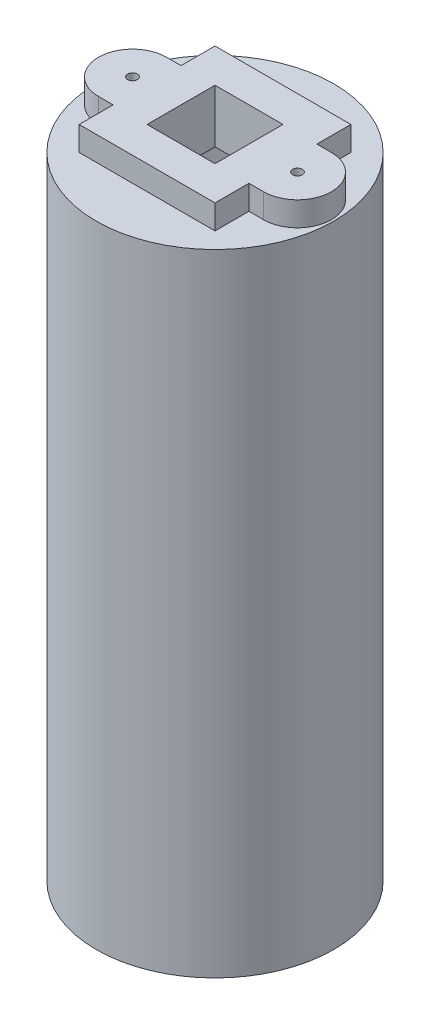
ISO-10303-21;
HEADER;
FILE_DESCRIPTION(('STEP AP214'),'2;1');
FILE_NAME('part.step','',(''),(''),'','','');
FILE_SCHEMA(('AUTOMOTIVE_DESIGN { 1 0 10303 214 1 1 1 1 }'));
ENDSEC;
DATA;
#1=APPLICATION_CONTEXT('core data for automotive mechanical design processes');
#2=APPLICATION_PROTOCOL_DEFINITION('international standard','automotive_design',2000,#1);
#3=PRODUCT_CONTEXT('',#1,'mechanical');
#4=PRODUCT('Part','Part','',(#3));
#5=PRODUCT_RELATED_PRODUCT_CATEGORY('part','',(#4));
#6=PRODUCT_DEFINITION_FORMATION('','',#4);
#7=PRODUCT_DEFINITION_CONTEXT('part definition',#1,'design');
#8=PRODUCT_DEFINITION('design','',#6,#7);
#9=PRODUCT_DEFINITION_SHAPE('','',#8);
#10=(LENGTH_UNIT() NAMED_UNIT(*) SI_UNIT(.MILLI.,.METRE.));
#11=(NAMED_UNIT(*) PLANE_ANGLE_UNIT() SI_UNIT($,.RADIAN.));
#12=(NAMED_UNIT(*) SI_UNIT($,.STERADIAN.) SOLID_ANGLE_UNIT());
#13=UNCERTAINTY_MEASURE_WITH_UNIT(LENGTH_MEASURE(1.E-05),#10,'distance_accuracy_value','');
#14=(GEOMETRIC_REPRESENTATION_CONTEXT(3) GLOBAL_UNCERTAINTY_ASSIGNED_CONTEXT((#13)) GLOBAL_UNIT_ASSIGNED_CONTEXT((#10,
#11,#12)) REPRESENTATION_CONTEXT('',''));
#15=CARTESIAN_POINT('',(0.,0.,0.));
#16=DIRECTION('',(0.,0.,1.));
#17=DIRECTION('',(1.,0.,0.));
#18=AXIS2_PLACEMENT_3D('',#15,#16,#17);
#19=CARTESIAN_POINT('',(0.,0.,0.));
#20=DIRECTION('',(0.,1.,0.));
#21=DIRECTION('',(0.,0.,1.));
#22=AXIS2_PLACEMENT_3D('',#19,#20,#21);
#23=PLANE('',#22);
#24=CARTESIAN_POINT('',(0.,0.,0.));
#25=DIRECTION('',(0.,1.,0.));
#26=DIRECTION('',(0.,0.,1.));
#27=AXIS2_PLACEMENT_3D('',#24,#25,#26);
#28=CIRCLE('',#27,12.25);
#29=CARTESIAN_POINT('',(0.,0.,12.25));
#30=VERTEX_POINT('',#29);
#31=EDGE_CURVE('E156',#30,#30,#28,.T.);
#32=ORIENTED_EDGE('',*,*,#31,.F.);
#33=EDGE_LOOP('',(#32));
#34=FACE_BOUND('',#33,.T.);
#35=CARTESIAN_POINT('',(0.,0.,0.));
#36=DIRECTION('',(0.,1.,0.));
#37=DIRECTION('',(0.,0.,1.));
#38=AXIS2_PLACEMENT_3D('',#35,#36,#37);
#39=CIRCLE('',#38,10.5);
#40=CARTESIAN_POINT('',(0.,0.,10.5));
#41=VERTEX_POINT('',#40);
#42=EDGE_CURVE('E174',#41,#41,#39,.T.);
#43=ORIENTED_EDGE('',*,*,#42,.T.);
#44=EDGE_LOOP('',(#43));
#45=FACE_BOUND('',#44,.T.);
#46=ADVANCED_FACE('F41',(#34,#45),#23,.F.);
#47=CARTESIAN_POINT('',(0.,62.,0.));
#48=DIRECTION('',(0.,-1.,0.));
#49=DIRECTION('',(0.,0.,-1.));
#50=AXIS2_PLACEMENT_3D('',#47,#48,#49);
#51=CYLINDRICAL_SURFACE('',#50,12.25);
#52=ORIENTED_EDGE('',*,*,#31,.T.);
#53=EDGE_LOOP('',(#52));
#54=FACE_BOUND('',#53,.T.);
#55=CARTESIAN_POINT('',(0.,65.,0.));
#56=DIRECTION('',(0.,1.,0.));
#57=DIRECTION('',(0.,0.,1.));
#58=AXIS2_PLACEMENT_3D('',#55,#56,#57);
#59=CIRCLE('',#58,12.25);
#60=CARTESIAN_POINT('',(0.,65.,12.25));
#61=VERTEX_POINT('',#60);
#62=EDGE_CURVE('E180',#61,#61,#59,.T.);
#63=ORIENTED_EDGE('',*,*,#62,.F.);
#64=EDGE_LOOP('',(#63));
#65=FACE_BOUND('',#64,.T.);
#66=ADVANCED_FACE('F43',(#54,#65),#51,.T.);
#67=CARTESIAN_POINT('',(0.,62.,0.));
#68=DIRECTION('',(0.,-1.,0.));
#69=DIRECTION('',(0.,0.,-1.));
#70=AXIS2_PLACEMENT_3D('',#67,#68,#69);
#71=CYLINDRICAL_SURFACE('',#70,10.5);
#72=CARTESIAN_POINT('',(0.,62.,0.));
#73=DIRECTION('',(0.,1.,0.));
#74=DIRECTION('',(0.,0.,1.));
#75=AXIS2_PLACEMENT_3D('',#72,#73,#74);
#76=CIRCLE('',#75,10.5);
#77=CARTESIAN_POINT('',(0.,62.,10.5));
#78=VERTEX_POINT('',#77);
#79=EDGE_CURVE('E177',#78,#78,#76,.T.);
#80=ORIENTED_EDGE('',*,*,#79,.T.);
#81=EDGE_LOOP('',(#80));
#82=FACE_BOUND('',#81,.T.);
#83=ORIENTED_EDGE('',*,*,#42,.F.);
#84=EDGE_LOOP('',(#83));
#85=FACE_BOUND('',#84,.T.);
#86=ADVANCED_FACE('F307',(#82,#85),#71,.F.);
#87=CARTESIAN_POINT('',(0.,62.,0.));
#88=DIRECTION('',(0.,1.,0.));
#89=DIRECTION('',(0.,0.,1.));
#90=AXIS2_PLACEMENT_3D('',#87,#88,#89);
#91=PLANE('',#90);
#92=DIRECTION('',(1.,0.,0.));
#93=VECTOR('',#92,1.);
#94=CARTESIAN_POINT('',(0.,62.,3.5));
#95=LINE('',#94,#93);
#96=CARTESIAN_POINT('',(-3.5,62.,3.5));
#97=VERTEX_POINT('',#96);
#98=CARTESIAN_POINT('',(3.5,62.,3.5));
#99=VERTEX_POINT('',#98);
#100=EDGE_CURVE('E287',#97,#99,#95,.T.);
#101=ORIENTED_EDGE('',*,*,#100,.T.);
#102=DIRECTION('',(0.,0.,-1.));
#103=VECTOR('',#102,1.);
#104=CARTESIAN_POINT('',(3.5,62.,0.));
#105=LINE('',#104,#103);
#106=CARTESIAN_POINT('',(3.5,62.,-3.5));
#107=VERTEX_POINT('',#106);
#108=EDGE_CURVE('E251',#99,#107,#105,.T.);
#109=ORIENTED_EDGE('',*,*,#108,.T.);
#110=DIRECTION('',(-1.,0.,0.));
#111=VECTOR('',#110,1.);
#112=CARTESIAN_POINT('',(0.,62.,-3.5));
#113=LINE('',#112,#111);
#114=CARTESIAN_POINT('',(-3.5,62.,-3.5));
#115=VERTEX_POINT('',#114);
#116=EDGE_CURVE('E291',#107,#115,#113,.T.);
#117=ORIENTED_EDGE('',*,*,#116,.T.);
#118=DIRECTION('',(0.,0.,1.));
#119=VECTOR('',#118,1.);
#120=CARTESIAN_POINT('',(-3.5,62.,0.));
#121=LINE('',#120,#119);
#122=EDGE_CURVE('E163',#115,#97,#121,.T.);
#123=ORIENTED_EDGE('',*,*,#122,.T.);
#124=EDGE_LOOP('',(#101,#109,#117,#123));
#125=FACE_BOUND('',#124,.T.);
#126=ORIENTED_EDGE('',*,*,#79,.F.);
#127=EDGE_LOOP('',(#126));
#128=FACE_BOUND('',#127,.T.);
#129=ADVANCED_FACE('F303',(#125,#128),#91,.F.);
#130=CARTESIAN_POINT('',(0.,65.,0.));
#131=DIRECTION('',(0.,1.,0.));
#132=DIRECTION('',(0.,0.,1.));
#133=AXIS2_PLACEMENT_3D('',#130,#131,#132);
#134=PLANE('',#133);
#135=DIRECTION('',(0.,0.,1.));
#136=VECTOR('',#135,1.);
#137=CARTESIAN_POINT('',(-7.,65.,0.));
#138=LINE('',#137,#136);
#139=CARTESIAN_POINT('',(-7.,65.,-7.));
#140=VERTEX_POINT('',#139);
#141=CARTESIAN_POINT('',(-7.,65.,-3.5));
#142=VERTEX_POINT('',#141);
#143=EDGE_CURVE('E249',#140,#142,#138,.T.);
#144=ORIENTED_EDGE('',*,*,#143,.F.);
#145=DIRECTION('',(1.,0.,0.));
#146=VECTOR('',#145,1.);
#147=CARTESIAN_POINT('',(0.,65.,-7.));
#148=LINE('',#147,#146);
#149=CARTESIAN_POINT('',(7.,65.,-7.));
#150=VERTEX_POINT('',#149);
#151=EDGE_CURVE('E220',#140,#150,#148,.T.);
#152=ORIENTED_EDGE('',*,*,#151,.T.);
#153=DIRECTION('',(0.,0.,1.));
#154=VECTOR('',#153,1.);
#155=CARTESIAN_POINT('',(7.,65.,0.));
#156=LINE('',#155,#154);
#157=CARTESIAN_POINT('',(7.,65.,-3.5));
#158=VERTEX_POINT('',#157);
#159=EDGE_CURVE('E223',#150,#158,#156,.T.);
#160=ORIENTED_EDGE('',*,*,#159,.T.);
#161=DIRECTION('',(1.,0.,0.));
#162=VECTOR('',#161,1.);
#163=CARTESIAN_POINT('',(0.,65.,-3.5));
#164=LINE('',#163,#162);
#165=CARTESIAN_POINT('',(8.5,65.,-3.5));
#166=VERTEX_POINT('',#165);
#167=EDGE_CURVE('E226',#158,#166,#164,.T.);
#168=ORIENTED_EDGE('',*,*,#167,.T.);
#169=CARTESIAN_POINT('',(8.5,65.,0.));
#170=DIRECTION('',(0.,1.,0.));
#171=DIRECTION('',(0.,0.,1.));
#172=AXIS2_PLACEMENT_3D('',#169,#170,#171);
#173=CIRCLE('',#172,3.5);
#174=CARTESIAN_POINT('',(8.5,65.,3.5));
#175=VERTEX_POINT('',#174);
#176=EDGE_CURVE('E229',#175,#166,#173,.T.);
#177=ORIENTED_EDGE('',*,*,#176,.F.);
#178=DIRECTION('',(1.,0.,0.));
#179=VECTOR('',#178,1.);
#180=CARTESIAN_POINT('',(0.,65.,3.5));
#181=LINE('',#180,#179);
#182=CARTESIAN_POINT('',(7.,65.,3.5));
#183=VERTEX_POINT('',#182);
#184=EDGE_CURVE('E232',#183,#175,#181,.T.);
#185=ORIENTED_EDGE('',*,*,#184,.F.);
#186=DIRECTION('',(0.,0.,1.));
#187=VECTOR('',#186,1.);
#188=CARTESIAN_POINT('',(7.,65.,0.));
#189=LINE('',#188,#187);
#190=CARTESIAN_POINT('',(7.,65.,7.));
#191=VERTEX_POINT('',#190);
#192=EDGE_CURVE('E234',#183,#191,#189,.T.);
#193=ORIENTED_EDGE('',*,*,#192,.T.);
#194=DIRECTION('',(1.,0.,0.));
#195=VECTOR('',#194,1.);
#196=CARTESIAN_POINT('',(0.,65.,7.));
#197=LINE('',#196,#195);
#198=CARTESIAN_POINT('',(-7.,65.,7.));
#199=VERTEX_POINT('',#198);
#200=EDGE_CURVE('E237',#199,#191,#197,.T.);
#201=ORIENTED_EDGE('',*,*,#200,.F.);
#202=DIRECTION('',(0.,0.,1.));
#203=VECTOR('',#202,1.);
#204=CARTESIAN_POINT('',(-7.,65.,0.));
#205=LINE('',#204,#203);
#206=CARTESIAN_POINT('',(-7.,65.,3.5));
#207=VERTEX_POINT('',#206);
#208=EDGE_CURVE('E240',#207,#199,#205,.T.);
#209=ORIENTED_EDGE('',*,*,#208,.F.);
#210=DIRECTION('',(1.,0.,0.));
#211=VECTOR('',#210,1.);
#212=CARTESIAN_POINT('',(0.,65.,3.5));
#213=LINE('',#212,#211);
#214=CARTESIAN_POINT('',(-8.5,65.,3.5));
#215=VERTEX_POINT('',#214);
#216=EDGE_CURVE('E242',#215,#207,#213,.T.);
#217=ORIENTED_EDGE('',*,*,#216,.F.);
#218=CARTESIAN_POINT('',(-8.5,65.,0.));
#219=DIRECTION('',(0.,1.,0.));
#220=DIRECTION('',(0.,0.,1.));
#221=AXIS2_PLACEMENT_3D('',#218,#219,#220);
#222=CIRCLE('',#221,3.5);
#223=CARTESIAN_POINT('',(-8.5,65.,-3.5));
#224=VERTEX_POINT('',#223);
#225=EDGE_CURVE('E244',#224,#215,#222,.T.);
#226=ORIENTED_EDGE('',*,*,#225,.F.);
#227=DIRECTION('',(1.,0.,0.));
#228=VECTOR('',#227,1.);
#229=CARTESIAN_POINT('',(0.,65.,-3.5));
#230=LINE('',#229,#228);
#231=EDGE_CURVE('E246',#224,#142,#230,.T.);
#232=ORIENTED_EDGE('',*,*,#231,.T.);
#233=EDGE_LOOP('',(#144,#152,#160,#168,#177,#185,#193,#201,#209,#217,#226,#232));
#234=FACE_BOUND('',#233,.T.);
#235=ORIENTED_EDGE('',*,*,#62,.T.);
#236=EDGE_LOOP('',(#235));
#237=FACE_BOUND('',#236,.T.);
#238=ADVANCED_FACE('F306',(#234,#237),#134,.T.);
#239=CARTESIAN_POINT('',(-7.,67.5,0.));
#240=DIRECTION('',(1.,0.,0.));
#241=DIRECTION('',(0.,0.,-1.));
#242=AXIS2_PLACEMENT_3D('',#239,#240,#241);
#243=PLANE('',#242);
#244=ORIENTED_EDGE('',*,*,#143,.T.);
#245=DIRECTION('',(0.,-1.,0.));
#246=VECTOR('',#245,1.);
#247=CARTESIAN_POINT('',(-7.,67.5,-3.5));
#248=LINE('',#247,#246);
#249=CARTESIAN_POINT('',(-7.,67.5,-3.5));
#250=VERTEX_POINT('',#249);
#251=EDGE_CURVE('E183',#250,#142,#248,.T.);
#252=ORIENTED_EDGE('',*,*,#251,.F.);
#253=DIRECTION('',(0.,0.,1.));
#254=VECTOR('',#253,1.);
#255=CARTESIAN_POINT('',(-7.,67.5,0.));
#256=LINE('',#255,#254);
#257=CARTESIAN_POINT('',(-7.,67.5,-7.));
#258=VERTEX_POINT('',#257);
#259=EDGE_CURVE('E216',#258,#250,#256,.T.);
#260=ORIENTED_EDGE('',*,*,#259,.F.);
#261=DIRECTION('',(0.,-1.,0.));
#262=VECTOR('',#261,1.);
#263=CARTESIAN_POINT('',(-7.,67.5,-7.));
#264=LINE('',#263,#262);
#265=EDGE_CURVE('E210',#258,#140,#264,.T.);
#266=ORIENTED_EDGE('',*,*,#265,.T.);
#267=EDGE_LOOP('',(#244,#252,#260,#266));
#268=FACE_BOUND('',#267,.T.);
#269=ADVANCED_FACE('F326',(#268),#243,.F.);
#270=CARTESIAN_POINT('',(0.,67.5,-3.5));
#271=DIRECTION('',(0.,0.,-1.));
#272=DIRECTION('',(-1.,0.,0.));
#273=AXIS2_PLACEMENT_3D('',#270,#271,#272);
#274=PLANE('',#273);
#275=ORIENTED_EDGE('',*,*,#231,.F.);
#276=DIRECTION('',(0.,-1.,0.));
#277=VECTOR('',#276,1.);
#278=CARTESIAN_POINT('',(-8.5,67.5,-3.5));
#279=LINE('',#278,#277);
#280=CARTESIAN_POINT('',(-8.5,67.5,-3.5));
#281=VERTEX_POINT('',#280);
#282=EDGE_CURVE('E186',#281,#224,#279,.T.);
#283=ORIENTED_EDGE('',*,*,#282,.F.);
#284=DIRECTION('',(1.,0.,0.));
#285=VECTOR('',#284,1.);
#286=CARTESIAN_POINT('',(0.,67.5,-3.5));
#287=LINE('',#286,#285);
#288=EDGE_CURVE('E281',#281,#250,#287,.T.);
#289=ORIENTED_EDGE('',*,*,#288,.T.);
#290=ORIENTED_EDGE('',*,*,#251,.T.);
#291=EDGE_LOOP('',(#275,#283,#289,#290));
#292=FACE_BOUND('',#291,.T.);
#293=ADVANCED_FACE('F332',(#292),#274,.T.);
#294=CARTESIAN_POINT('',(-8.5,67.5,0.));
#295=DIRECTION('',(0.,-1.,0.));
#296=DIRECTION('',(0.,0.,-1.));
#297=AXIS2_PLACEMENT_3D('',#294,#295,#296);
#298=CYLINDRICAL_SURFACE('',#297,3.5);
#299=ORIENTED_EDGE('',*,*,#225,.T.);
#300=DIRECTION('',(0.,-1.,0.));
#301=VECTOR('',#300,1.);
#302=CARTESIAN_POINT('',(-8.5,67.5,3.5));
#303=LINE('',#302,#301);
#304=CARTESIAN_POINT('',(-8.5,67.5,3.5));
#305=VERTEX_POINT('',#304);
#306=EDGE_CURVE('E188',#305,#215,#303,.T.);
#307=ORIENTED_EDGE('',*,*,#306,.F.);
#308=CARTESIAN_POINT('',(-8.5,67.5,0.));
#309=DIRECTION('',(0.,1.,0.));
#310=DIRECTION('',(0.,0.,1.));
#311=AXIS2_PLACEMENT_3D('',#308,#309,#310);
#312=CIRCLE('',#311,3.5);
#313=EDGE_CURVE('E279',#281,#305,#312,.T.);
#314=ORIENTED_EDGE('',*,*,#313,.F.);
#315=ORIENTED_EDGE('',*,*,#282,.T.);
#316=EDGE_LOOP('',(#299,#307,#314,#315));
#317=FACE_BOUND('',#316,.T.);
#318=ADVANCED_FACE('F336',(#317),#298,.T.);
#319=CARTESIAN_POINT('',(0.,67.5,3.5));
#320=DIRECTION('',(0.,0.,-1.));
#321=DIRECTION('',(-1.,0.,0.));
#322=AXIS2_PLACEMENT_3D('',#319,#320,#321);
#323=PLANE('',#322);
#324=ORIENTED_EDGE('',*,*,#216,.T.);
#325=DIRECTION('',(0.,-1.,0.));
#326=VECTOR('',#325,1.);
#327=CARTESIAN_POINT('',(-7.,67.5,3.5));
#328=LINE('',#327,#326);
#329=CARTESIAN_POINT('',(-7.,67.5,3.5));
#330=VERTEX_POINT('',#329);
#331=EDGE_CURVE('E191',#330,#207,#328,.T.);
#332=ORIENTED_EDGE('',*,*,#331,.F.);
#333=DIRECTION('',(1.,0.,0.));
#334=VECTOR('',#333,1.);
#335=CARTESIAN_POINT('',(0.,67.5,3.5));
#336=LINE('',#335,#334);
#337=EDGE_CURVE('E277',#305,#330,#336,.T.);
#338=ORIENTED_EDGE('',*,*,#337,.F.);
#339=ORIENTED_EDGE('',*,*,#306,.T.);
#340=EDGE_LOOP('',(#324,#332,#338,#339));
#341=FACE_BOUND('',#340,.T.);
#342=ADVANCED_FACE('F340',(#341),#323,.F.);
#343=CARTESIAN_POINT('',(-7.,67.5,0.));
#344=DIRECTION('',(1.,0.,0.));
#345=DIRECTION('',(0.,0.,-1.));
#346=AXIS2_PLACEMENT_3D('',#343,#344,#345);
#347=PLANE('',#346);
#348=ORIENTED_EDGE('',*,*,#208,.T.);
#349=DIRECTION('',(0.,-1.,0.));
#350=VECTOR('',#349,1.);
#351=CARTESIAN_POINT('',(-7.,67.5,7.));
#352=LINE('',#351,#350);
#353=CARTESIAN_POINT('',(-7.,67.5,7.));
#354=VERTEX_POINT('',#353);
#355=EDGE_CURVE('E194',#354,#199,#352,.T.);
#356=ORIENTED_EDGE('',*,*,#355,.F.);
#357=DIRECTION('',(0.,0.,1.));
#358=VECTOR('',#357,1.);
#359=CARTESIAN_POINT('',(-7.,67.5,0.));
#360=LINE('',#359,#358);
#361=EDGE_CURVE('E275',#330,#354,#360,.T.);
#362=ORIENTED_EDGE('',*,*,#361,.F.);
#363=ORIENTED_EDGE('',*,*,#331,.T.);
#364=EDGE_LOOP('',(#348,#356,#362,#363));
#365=FACE_BOUND('',#364,.T.);
#366=ADVANCED_FACE('F344',(#365),#347,.F.);
#367=CARTESIAN_POINT('',(0.,67.5,7.));
#368=DIRECTION('',(0.,0.,-1.));
#369=DIRECTION('',(-1.,0.,0.));
#370=AXIS2_PLACEMENT_3D('',#367,#368,#369);
#371=PLANE('',#370);
#372=ORIENTED_EDGE('',*,*,#200,.T.);
#373=DIRECTION('',(0.,-1.,0.));
#374=VECTOR('',#373,1.);
#375=CARTESIAN_POINT('',(7.,67.5,7.));
#376=LINE('',#375,#374);
#377=CARTESIAN_POINT('',(7.,67.5,7.));
#378=VERTEX_POINT('',#377);
#379=EDGE_CURVE('E197',#378,#191,#376,.T.);
#380=ORIENTED_EDGE('',*,*,#379,.F.);
#381=DIRECTION('',(1.,0.,0.));
#382=VECTOR('',#381,1.);
#383=CARTESIAN_POINT('',(0.,67.5,7.));
#384=LINE('',#383,#382);
#385=EDGE_CURVE('E273',#354,#378,#384,.T.);
#386=ORIENTED_EDGE('',*,*,#385,.F.);
#387=ORIENTED_EDGE('',*,*,#355,.T.);
#388=EDGE_LOOP('',(#372,#380,#386,#387));
#389=FACE_BOUND('',#388,.T.);
#390=ADVANCED_FACE('F348',(#389),#371,.F.);
#391=CARTESIAN_POINT('',(7.,67.5,0.));
#392=DIRECTION('',(1.,0.,0.));
#393=DIRECTION('',(0.,0.,-1.));
#394=AXIS2_PLACEMENT_3D('',#391,#392,#393);
#395=PLANE('',#394);
#396=ORIENTED_EDGE('',*,*,#192,.F.);
#397=DIRECTION('',(0.,-1.,0.));
#398=VECTOR('',#397,1.);
#399=CARTESIAN_POINT('',(7.,67.5,3.5));
#400=LINE('',#399,#398);
#401=CARTESIAN_POINT('',(7.,67.5,3.5));
#402=VERTEX_POINT('',#401);
#403=EDGE_CURVE('E199',#402,#183,#400,.T.);
#404=ORIENTED_EDGE('',*,*,#403,.F.);
#405=DIRECTION('',(0.,0.,1.));
#406=VECTOR('',#405,1.);
#407=CARTESIAN_POINT('',(7.,67.5,0.));
#408=LINE('',#407,#406);
#409=EDGE_CURVE('E270',#402,#378,#408,.T.);
#410=ORIENTED_EDGE('',*,*,#409,.T.);
#411=ORIENTED_EDGE('',*,*,#379,.T.);
#412=EDGE_LOOP('',(#396,#404,#410,#411));
#413=FACE_BOUND('',#412,.T.);
#414=ADVANCED_FACE('F352',(#413),#395,.T.);
#415=CARTESIAN_POINT('',(0.,67.5,3.5));
#416=DIRECTION('',(0.,0.,-1.));
#417=DIRECTION('',(-1.,0.,0.));
#418=AXIS2_PLACEMENT_3D('',#415,#416,#417);
#419=PLANE('',#418);
#420=ORIENTED_EDGE('',*,*,#184,.T.);
#421=DIRECTION('',(0.,-1.,0.));
#422=VECTOR('',#421,1.);
#423=CARTESIAN_POINT('',(8.5,67.5,3.5));
#424=LINE('',#423,#422);
#425=CARTESIAN_POINT('',(8.5,67.5,3.5));
#426=VERTEX_POINT('',#425);
#427=EDGE_CURVE('E201',#426,#175,#424,.T.);
#428=ORIENTED_EDGE('',*,*,#427,.F.);
#429=DIRECTION('',(1.,0.,0.));
#430=VECTOR('',#429,1.);
#431=CARTESIAN_POINT('',(0.,67.5,3.5));
#432=LINE('',#431,#430);
#433=EDGE_CURVE('E268',#402,#426,#432,.T.);
#434=ORIENTED_EDGE('',*,*,#433,.F.);
#435=ORIENTED_EDGE('',*,*,#403,.T.);
#436=EDGE_LOOP('',(#420,#428,#434,#435));
#437=FACE_BOUND('',#436,.T.);
#438=ADVANCED_FACE('F356',(#437),#419,.F.);
#439=CARTESIAN_POINT('',(8.5,67.5,0.));
#440=DIRECTION('',(0.,-1.,0.));
#441=DIRECTION('',(0.,0.,-1.));
#442=AXIS2_PLACEMENT_3D('',#439,#440,#441);
#443=CYLINDRICAL_SURFACE('',#442,3.5);
#444=ORIENTED_EDGE('',*,*,#176,.T.);
#445=DIRECTION('',(0.,-1.,0.));
#446=VECTOR('',#445,1.);
#447=CARTESIAN_POINT('',(8.5,67.5,-3.5));
#448=LINE('',#447,#446);
#449=CARTESIAN_POINT('',(8.5,67.5,-3.5));
#450=VERTEX_POINT('',#449);
#451=EDGE_CURVE('E204',#450,#166,#448,.T.);
#452=ORIENTED_EDGE('',*,*,#451,.F.);
#453=CARTESIAN_POINT('',(8.5,67.5,0.));
#454=DIRECTION('',(0.,1.,0.));
#455=DIRECTION('',(0.,0.,1.));
#456=AXIS2_PLACEMENT_3D('',#453,#454,#455);
#457=CIRCLE('',#456,3.5);
#458=EDGE_CURVE('E266',#426,#450,#457,.T.);
#459=ORIENTED_EDGE('',*,*,#458,.F.);
#460=ORIENTED_EDGE('',*,*,#427,.T.);
#461=EDGE_LOOP('',(#444,#452,#459,#460));
#462=FACE_BOUND('',#461,.T.);
#463=ADVANCED_FACE('F360',(#462),#443,.T.);
#464=CARTESIAN_POINT('',(0.,67.5,-3.5));
#465=DIRECTION('',(0.,0.,-1.));
#466=DIRECTION('',(-1.,0.,0.));
#467=AXIS2_PLACEMENT_3D('',#464,#465,#466);
#468=PLANE('',#467);
#469=ORIENTED_EDGE('',*,*,#167,.F.);
#470=DIRECTION('',(0.,-1.,0.));
#471=VECTOR('',#470,1.);
#472=CARTESIAN_POINT('',(7.,67.5,-3.5));
#473=LINE('',#472,#471);
#474=CARTESIAN_POINT('',(7.,67.5,-3.5));
#475=VERTEX_POINT('',#474);
#476=EDGE_CURVE('E206',#475,#158,#473,.T.);
#477=ORIENTED_EDGE('',*,*,#476,.F.);
#478=DIRECTION('',(1.,0.,0.));
#479=VECTOR('',#478,1.);
#480=CARTESIAN_POINT('',(0.,67.5,-3.5));
#481=LINE('',#480,#479);
#482=EDGE_CURVE('E263',#475,#450,#481,.T.);
#483=ORIENTED_EDGE('',*,*,#482,.T.);
#484=ORIENTED_EDGE('',*,*,#451,.T.);
#485=EDGE_LOOP('',(#469,#477,#483,#484));
#486=FACE_BOUND('',#485,.T.);
#487=ADVANCED_FACE('F364',(#486),#468,.T.);
#488=CARTESIAN_POINT('',(7.,67.5,0.));
#489=DIRECTION('',(1.,0.,0.));
#490=DIRECTION('',(0.,0.,-1.));
#491=AXIS2_PLACEMENT_3D('',#488,#489,#490);
#492=PLANE('',#491);
#493=ORIENTED_EDGE('',*,*,#159,.F.);
#494=DIRECTION('',(0.,-1.,0.));
#495=VECTOR('',#494,1.);
#496=CARTESIAN_POINT('',(7.,67.5,-7.));
#497=LINE('',#496,#495);
#498=CARTESIAN_POINT('',(7.,67.5,-7.));
#499=VERTEX_POINT('',#498);
#500=EDGE_CURVE('E208',#499,#150,#497,.T.);
#501=ORIENTED_EDGE('',*,*,#500,.F.);
#502=DIRECTION('',(0.,0.,1.));
#503=VECTOR('',#502,1.);
#504=CARTESIAN_POINT('',(7.,67.5,0.));
#505=LINE('',#504,#503);
#506=EDGE_CURVE('E260',#499,#475,#505,.T.);
#507=ORIENTED_EDGE('',*,*,#506,.T.);
#508=ORIENTED_EDGE('',*,*,#476,.T.);
#509=EDGE_LOOP('',(#493,#501,#507,#508));
#510=FACE_BOUND('',#509,.T.);
#511=ADVANCED_FACE('F368',(#510),#492,.T.);
#512=CARTESIAN_POINT('',(8.5,67.5,0.));
#513=DIRECTION('',(0.,-1.,0.));
#514=DIRECTION('',(0.,0.,-1.));
#515=AXIS2_PLACEMENT_3D('',#512,#513,#514);
#516=CYLINDRICAL_SURFACE('',#515,0.500000000000001);
#517=CARTESIAN_POINT('',(8.5,67.5,0.));
#518=DIRECTION('',(0.,1.,0.));
#519=DIRECTION('',(0.,0.,1.));
#520=AXIS2_PLACEMENT_3D('',#517,#518,#519);
#521=CIRCLE('',#520,0.500000000000001);
#522=CARTESIAN_POINT('',(8.5,67.5,0.499999999999998));
#523=VERTEX_POINT('',#522);
#524=EDGE_CURVE('E254',#523,#523,#521,.T.);
#525=ORIENTED_EDGE('',*,*,#524,.T.);
#526=EDGE_LOOP('',(#525));
#527=FACE_BOUND('',#526,.T.);
#528=CARTESIAN_POINT('',(8.5,65.,0.));
#529=DIRECTION('',(0.,1.,0.));
#530=DIRECTION('',(0.,0.,1.));
#531=AXIS2_PLACEMENT_3D('',#528,#529,#530);
#532=CIRCLE('',#531,0.500000000000001);
#533=CARTESIAN_POINT('',(8.5,65.,0.499999999999998));
#534=VERTEX_POINT('',#533);
#535=EDGE_CURVE('E217',#534,#534,#532,.T.);
#536=ORIENTED_EDGE('',*,*,#535,.F.);
#537=EDGE_LOOP('',(#536));
#538=FACE_BOUND('',#537,.T.);
#539=ADVANCED_FACE('F372',(#527,#538),#516,.F.);
#540=CARTESIAN_POINT('',(0.,67.5,-7.));
#541=DIRECTION('',(0.,0.,-1.));
#542=DIRECTION('',(-1.,0.,0.));
#543=AXIS2_PLACEMENT_3D('',#540,#541,#542);
#544=PLANE('',#543);
#545=ORIENTED_EDGE('',*,*,#151,.F.);
#546=ORIENTED_EDGE('',*,*,#265,.F.);
#547=DIRECTION('',(1.,0.,0.));
#548=VECTOR('',#547,1.);
#549=CARTESIAN_POINT('',(0.,67.5,-7.));
#550=LINE('',#549,#548);
#551=EDGE_CURVE('E257',#258,#499,#550,.T.);
#552=ORIENTED_EDGE('',*,*,#551,.T.);
#553=ORIENTED_EDGE('',*,*,#500,.T.);
#554=EDGE_LOOP('',(#545,#546,#552,#553));
#555=FACE_BOUND('',#554,.T.);
#556=ADVANCED_FACE('F374',(#555),#544,.T.);
#557=CARTESIAN_POINT('',(-8.5,67.5,0.));
#558=DIRECTION('',(0.,-1.,0.));
#559=DIRECTION('',(0.,0.,-1.));
#560=AXIS2_PLACEMENT_3D('',#557,#558,#559);
#561=CYLINDRICAL_SURFACE('',#560,0.500000000000001);
#562=CARTESIAN_POINT('',(-8.5,67.5,0.));
#563=DIRECTION('',(0.,1.,0.));
#564=DIRECTION('',(0.,0.,1.));
#565=AXIS2_PLACEMENT_3D('',#562,#563,#564);
#566=CIRCLE('',#565,0.500000000000001);
#567=CARTESIAN_POINT('',(-8.5,67.5,0.500000000000001));
#568=VERTEX_POINT('',#567);
#569=EDGE_CURVE('E212',#568,#568,#566,.T.);
#570=ORIENTED_EDGE('',*,*,#569,.T.);
#571=EDGE_LOOP('',(#570));
#572=FACE_BOUND('',#571,.T.);
#573=CARTESIAN_POINT('',(-8.5,65.,0.));
#574=DIRECTION('',(0.,1.,0.));
#575=DIRECTION('',(0.,0.,1.));
#576=AXIS2_PLACEMENT_3D('',#573,#574,#575);
#577=CIRCLE('',#576,0.500000000000001);
#578=CARTESIAN_POINT('',(-8.5,65.,0.500000000000001));
#579=VERTEX_POINT('',#578);
#580=EDGE_CURVE('E213',#579,#579,#577,.T.);
#581=ORIENTED_EDGE('',*,*,#580,.F.);
#582=EDGE_LOOP('',(#581));
#583=FACE_BOUND('',#582,.T.);
#584=ADVANCED_FACE('F377',(#572,#583),#561,.F.);
#585=CARTESIAN_POINT('',(0.,67.5,0.));
#586=DIRECTION('',(0.,1.,0.));
#587=DIRECTION('',(0.,0.,1.));
#588=AXIS2_PLACEMENT_3D('',#585,#586,#587);
#589=PLANE('',#588);
#590=DIRECTION('',(0.,0.,-1.));
#591=VECTOR('',#590,1.);
#592=CARTESIAN_POINT('',(3.5,67.5,0.));
#593=LINE('',#592,#591);
#594=CARTESIAN_POINT('',(3.5,67.5,3.5));
#595=VERTEX_POINT('',#594);
#596=CARTESIAN_POINT('',(3.5,67.5,-3.5));
#597=VERTEX_POINT('',#596);
#598=EDGE_CURVE('E11',#595,#597,#593,.T.);
#599=ORIENTED_EDGE('',*,*,#598,.F.);
#600=DIRECTION('',(1.,0.,0.));
#601=VECTOR('',#600,1.);
#602=CARTESIAN_POINT('',(0.,67.5,3.5));
#603=LINE('',#602,#601);
#604=CARTESIAN_POINT('',(-3.5,67.5,3.5));
#605=VERTEX_POINT('',#604);
#606=EDGE_CURVE('E49',#605,#595,#603,.T.);
#607=ORIENTED_EDGE('',*,*,#606,.F.);
#608=DIRECTION('',(0.,0.,1.));
#609=VECTOR('',#608,1.);
#610=CARTESIAN_POINT('',(-3.5,67.5,0.));
#611=LINE('',#610,#609);
#612=CARTESIAN_POINT('',(-3.5,67.5,-3.5));
#613=VERTEX_POINT('',#612);
#614=EDGE_CURVE('E155',#613,#605,#611,.T.);
#615=ORIENTED_EDGE('',*,*,#614,.F.);
#616=DIRECTION('',(-1.,0.,0.));
#617=VECTOR('',#616,1.);
#618=CARTESIAN_POINT('',(0.,67.5,-3.5));
#619=LINE('',#618,#617);
#620=EDGE_CURVE('E150',#597,#613,#619,.T.);
#621=ORIENTED_EDGE('',*,*,#620,.F.);
#622=EDGE_LOOP('',(#599,#607,#615,#621));
#623=FACE_BOUND('',#622,.T.);
#624=ORIENTED_EDGE('',*,*,#259,.T.);
#625=ORIENTED_EDGE('',*,*,#288,.F.);
#626=ORIENTED_EDGE('',*,*,#313,.T.);
#627=ORIENTED_EDGE('',*,*,#337,.T.);
#628=ORIENTED_EDGE('',*,*,#361,.T.);
#629=ORIENTED_EDGE('',*,*,#385,.T.);
#630=ORIENTED_EDGE('',*,*,#409,.F.);
#631=ORIENTED_EDGE('',*,*,#433,.T.);
#632=ORIENTED_EDGE('',*,*,#458,.T.);
#633=ORIENTED_EDGE('',*,*,#482,.F.);
#634=ORIENTED_EDGE('',*,*,#506,.F.);
#635=ORIENTED_EDGE('',*,*,#551,.F.);
#636=EDGE_LOOP('',(#624,#625,#626,#627,#628,#629,#630,#631,#632,#633,#634,#635));
#637=FACE_BOUND('',#636,.T.);
#638=ORIENTED_EDGE('',*,*,#524,.F.);
#639=EDGE_LOOP('',(#638));
#640=FACE_BOUND('',#639,.T.);
#641=ORIENTED_EDGE('',*,*,#569,.F.);
#642=EDGE_LOOP('',(#641));
#643=FACE_BOUND('',#642,.T.);
#644=ADVANCED_FACE('F168',(#623,#637,#640,#643),#589,.T.);
#645=ORIENTED_EDGE('',*,*,#535,.T.);
#646=EDGE_LOOP('',(#645));
#647=FACE_BOUND('',#646,.T.);
#648=ADVANCED_FACE('F328',(#647),#134,.T.);
#649=ORIENTED_EDGE('',*,*,#580,.T.);
#650=EDGE_LOOP('',(#649));
#651=FACE_BOUND('',#650,.T.);
#652=ADVANCED_FACE('F329',(#651),#134,.T.);
#653=CARTESIAN_POINT('',(3.5,0.,-3.5));
#654=DIRECTION('',(1.,0.,0.));
#655=DIRECTION('',(0.,0.,-1.));
#656=AXIS2_PLACEMENT_3D('',#653,#654,#655);
#657=PLANE('',#656);
#658=DIRECTION('',(0.,1.,0.));
#659=VECTOR('',#658,1.);
#660=CARTESIAN_POINT('',(3.5,0.,3.5));
#661=LINE('',#660,#659);
#662=EDGE_CURVE('E293',#99,#595,#661,.T.);
#663=ORIENTED_EDGE('',*,*,#662,.T.);
#664=ORIENTED_EDGE('',*,*,#598,.T.);
#665=DIRECTION('',(0.,1.,0.));
#666=VECTOR('',#665,1.);
#667=CARTESIAN_POINT('',(3.5,0.,-3.5));
#668=LINE('',#667,#666);
#669=EDGE_CURVE('E61',#107,#597,#668,.T.);
#670=ORIENTED_EDGE('',*,*,#669,.F.);
#671=ORIENTED_EDGE('',*,*,#108,.F.);
#672=EDGE_LOOP('',(#663,#664,#670,#671));
#673=FACE_BOUND('',#672,.T.);
#674=ADVANCED_FACE('F299',(#673),#657,.F.);
#675=CARTESIAN_POINT('',(-3.5,0.,3.5));
#676=DIRECTION('',(0.,0.,1.));
#677=DIRECTION('',(1.,0.,0.));
#678=AXIS2_PLACEMENT_3D('',#675,#676,#677);
#679=PLANE('',#678);
#680=DIRECTION('',(0.,1.,0.));
#681=VECTOR('',#680,1.);
#682=CARTESIAN_POINT('',(-3.5,0.,3.5));
#683=LINE('',#682,#681);
#684=EDGE_CURVE('E165',#97,#605,#683,.T.);
#685=ORIENTED_EDGE('',*,*,#684,.T.);
#686=ORIENTED_EDGE('',*,*,#606,.T.);
#687=ORIENTED_EDGE('',*,*,#662,.F.);
#688=ORIENTED_EDGE('',*,*,#100,.F.);
#689=EDGE_LOOP('',(#685,#686,#687,#688));
#690=FACE_BOUND('',#689,.T.);
#691=ADVANCED_FACE('F301',(#690),#679,.F.);
#692=CARTESIAN_POINT('',(-3.5,0.,-3.5));
#693=DIRECTION('',(-1.,0.,0.));
#694=DIRECTION('',(0.,0.,1.));
#695=AXIS2_PLACEMENT_3D('',#692,#693,#694);
#696=PLANE('',#695);
#697=DIRECTION('',(0.,1.,0.));
#698=VECTOR('',#697,1.);
#699=CARTESIAN_POINT('',(-3.5,0.,-3.5));
#700=LINE('',#699,#698);
#701=EDGE_CURVE('E56',#115,#613,#700,.T.);
#702=ORIENTED_EDGE('',*,*,#701,.T.);
#703=ORIENTED_EDGE('',*,*,#614,.T.);
#704=ORIENTED_EDGE('',*,*,#684,.F.);
#705=ORIENTED_EDGE('',*,*,#122,.F.);
#706=EDGE_LOOP('',(#702,#703,#704,#705));
#707=FACE_BOUND('',#706,.T.);
#708=ADVANCED_FACE('F159',(#707),#696,.F.);
#709=CARTESIAN_POINT('',(-3.5,0.,-3.5));
#710=DIRECTION('',(0.,0.,-1.));
#711=DIRECTION('',(-1.,0.,0.));
#712=AXIS2_PLACEMENT_3D('',#709,#710,#711);
#713=PLANE('',#712);
#714=ORIENTED_EDGE('',*,*,#669,.T.);
#715=ORIENTED_EDGE('',*,*,#620,.T.);
#716=ORIENTED_EDGE('',*,*,#701,.F.);
#717=ORIENTED_EDGE('',*,*,#116,.F.);
#718=EDGE_LOOP('',(#714,#715,#716,#717));
#719=FACE_BOUND('',#718,.T.);
#720=ADVANCED_FACE('F151',(#719),#713,.F.);
#721=CLOSED_SHELL('',(#46,#66,#86,#129,#238,#269,#293,#318,#342,#366,#390,#414,#438,#463,#487,
#511,#539,#556,#584,#644,#648,#652,#674,#691,#708,#720));
#722=MANIFOLD_SOLID_BREP('B2',#721);
#723=ADVANCED_BREP_SHAPE_REPRESENTATION('',(#18,#722),#14);
#724=SHAPE_DEFINITION_REPRESENTATION(#9,#723);
ENDSEC;
END-ISO-10303-21;
